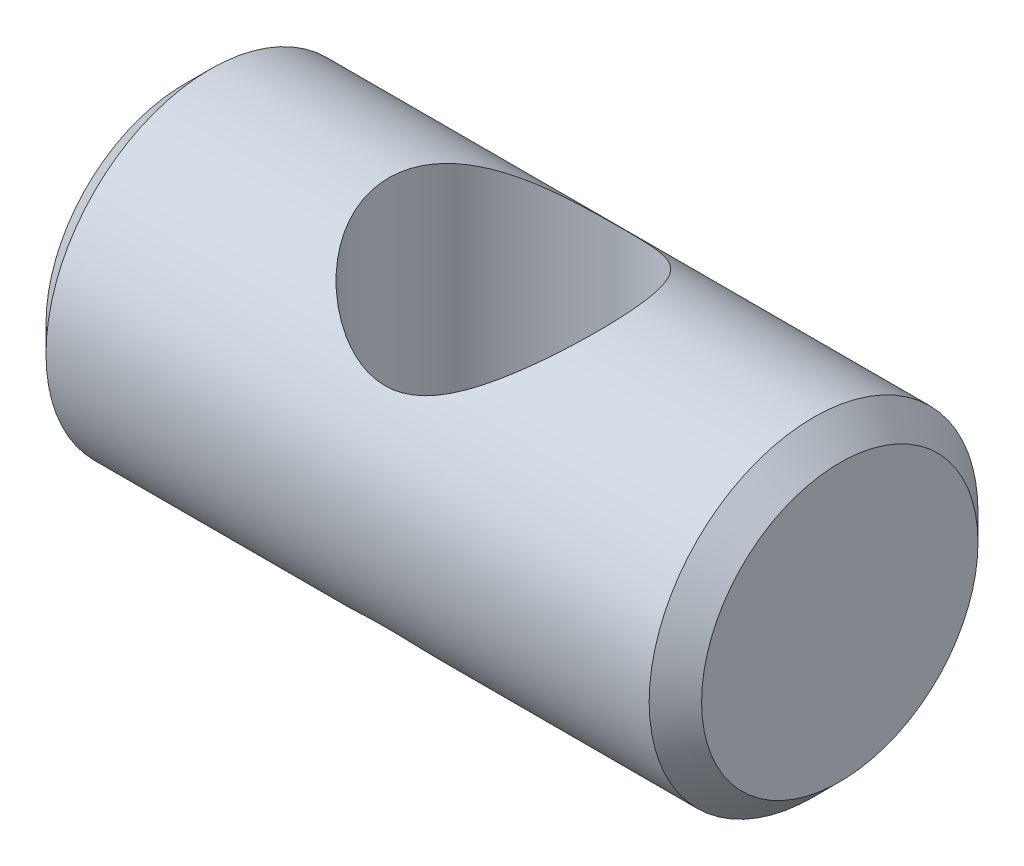
ISO-10303-21;
HEADER;
FILE_DESCRIPTION(('STEP AP214'),'2;1');
FILE_NAME('part.step','',(''),(''),'','','');
FILE_SCHEMA(('AUTOMOTIVE_DESIGN { 1 0 10303 214 1 1 1 1 }'));
ENDSEC;
DATA;
#1=APPLICATION_CONTEXT('core data for automotive mechanical design processes');
#2=APPLICATION_PROTOCOL_DEFINITION('international standard','automotive_design',2000,#1);
#3=PRODUCT_CONTEXT('',#1,'mechanical');
#4=PRODUCT('Part','Part','',(#3));
#5=PRODUCT_RELATED_PRODUCT_CATEGORY('part','',(#4));
#6=PRODUCT_DEFINITION_FORMATION('','',#4);
#7=PRODUCT_DEFINITION_CONTEXT('part definition',#1,'design');
#8=PRODUCT_DEFINITION('design','',#6,#7);
#9=PRODUCT_DEFINITION_SHAPE('','',#8);
#10=(LENGTH_UNIT() NAMED_UNIT(*) SI_UNIT(.MILLI.,.METRE.));
#11=(NAMED_UNIT(*) PLANE_ANGLE_UNIT() SI_UNIT($,.RADIAN.));
#12=(NAMED_UNIT(*) SI_UNIT($,.STERADIAN.) SOLID_ANGLE_UNIT());
#13=UNCERTAINTY_MEASURE_WITH_UNIT(LENGTH_MEASURE(1.E-05),#10,'distance_accuracy_value','');
#14=(GEOMETRIC_REPRESENTATION_CONTEXT(3) GLOBAL_UNCERTAINTY_ASSIGNED_CONTEXT((#13)) GLOBAL_UNIT_ASSIGNED_CONTEXT((#10,
#11,#12)) REPRESENTATION_CONTEXT('',''));
#15=CARTESIAN_POINT('',(0.,0.,0.));
#16=DIRECTION('',(0.,0.,1.));
#17=DIRECTION('',(1.,0.,0.));
#18=AXIS2_PLACEMENT_3D('',#15,#16,#17);
#19=CARTESIAN_POINT('',(9.5,0.,0.));
#20=DIRECTION('',(-1.,0.,0.));
#21=DIRECTION('',(0.,0.,1.));
#22=AXIS2_PLACEMENT_3D('',#19,#20,#21);
#23=CYLINDRICAL_SURFACE('',#22,4.765);
#24=CARTESIAN_POINT('',(-3.42087708051605,-4.765,0.));
#25=CARTESIAN_POINT('',(-3.42696899134864,-4.7649997101109,0.0833627581168181));
#26=CARTESIAN_POINT('',(-3.43001003086423,-4.76280757869707,0.166953392424251));
#27=CARTESIAN_POINT('',(-3.4299899120654,-4.75402028790231,0.333933182408652));
#28=CARTESIAN_POINT('',(-3.42692615604904,-4.74742325494959,0.41732223719261));
#29=CARTESIAN_POINT('',(-3.41478160746824,-4.72989865727235,0.583312250165056));
#30=CARTESIAN_POINT('',(-3.40569315136156,-4.71896558414041,0.665912068503747));
#31=CARTESIAN_POINT('',(-3.38168739143667,-4.69295834085159,0.829610597514771));
#32=CARTESIAN_POINT('',(-3.36676760565251,-4.67788240819801,0.91070865358331));
#33=CARTESIAN_POINT('',(-3.31382161536753,-4.62699847385246,1.15000632689336));
#34=CARTESIAN_POINT('',(-3.26752778272676,-4.58542013528299,1.30524951697123));
#35=CARTESIAN_POINT('',(-3.15544383432779,-4.48962808746058,1.60411463212557));
#36=CARTESIAN_POINT('',(-3.08965416222603,-4.43541466574349,1.74773682156028));
#37=CARTESIAN_POINT('',(-2.93522566350036,-4.31273538578719,2.03259497643689));
#38=CARTESIAN_POINT('',(-2.84518090003159,-4.24347672491827,2.17272279857911));
#39=CARTESIAN_POINT('',(-2.64803347355049,-4.09784606286129,2.43631552731587));
#40=CARTESIAN_POINT('',(-2.54091313456509,-4.02146672501527,2.55976291960052));
#41=CARTESIAN_POINT('',(-2.28757037498761,-3.84950291536883,2.81327393100644));
#42=CARTESIAN_POINT('',(-2.13784494064544,-3.75321839663728,2.93940806717613));
#43=CARTESIAN_POINT('',(-1.89774924473951,-3.61188607024724,3.10885207016274));
#44=CARTESIAN_POINT('',(-1.81509327318893,-3.56527135977744,3.16205944901992));
#45=CARTESIAN_POINT('',(-1.64456461914389,-3.47438917550769,3.26165283895997));
#46=CARTESIAN_POINT('',(-1.55669391813204,-3.43012082209569,3.30804141803447));
#47=CARTESIAN_POINT('',(-1.33801732923479,-3.32784018306176,3.41144333221737));
#48=CARTESIAN_POINT('',(-1.20454764001565,-3.27176419567389,3.46485738281701));
#49=CARTESIAN_POINT('',(-0.92756721927326,-3.17315327144381,3.55539465585279));
#50=CARTESIAN_POINT('',(-0.784080947165173,-3.13058666617785,3.59255605597934));
#51=CARTESIAN_POINT('',(-0.514646140223209,-3.07113542283653,3.64343651296181));
#52=CARTESIAN_POINT('',(-0.389980532152303,-3.05107413064414,3.66010628533956));
#53=CARTESIAN_POINT('',(-0.13805144197163,-3.02761567970702,3.67954153570878));
#54=CARTESIAN_POINT('',(-0.010790737951865,-3.02420155283186,3.68232117171679));
#55=CARTESIAN_POINT('',(0.242449329866106,-3.03458366659267,3.67376621747767));
#56=CARTESIAN_POINT('',(0.368429244158409,-3.04837216824954,3.66243797397314));
#57=CARTESIAN_POINT('',(0.615927376424317,-3.09094772918142,3.62657095184853));
#58=CARTESIAN_POINT('',(0.737438661719832,-3.11975712134959,3.60201250089043));
#59=CARTESIAN_POINT('',(1.02486117239319,-3.20358122773375,3.52797021750044));
#60=CARTESIAN_POINT('',(1.18741075414518,-3.26453704351351,3.47231020523667));
#61=CARTESIAN_POINT('',(1.498121783823,-3.39961296516166,3.34017866781708));
#62=CARTESIAN_POINT('',(1.64623815847782,-3.47377238661047,3.2636446149314));
#63=CARTESIAN_POINT('',(1.87825971607124,-3.60054284241464,3.12200897105521));
#64=CARTESIAN_POINT('',(1.9664324955114,-3.65156363596669,3.06234750531042));
#65=CARTESIAN_POINT('',(2.13658829521524,-3.75440484501345,2.93536296354977));
#66=CARTESIAN_POINT('',(2.21856944344932,-3.80622549668558,2.86803758566651));
#67=CARTESIAN_POINT('',(2.4548169203279,-3.96070606463684,2.65493557738645));
#68=CARTESIAN_POINT('',(2.59972905493882,-4.06258137631192,2.4978237985218));
#69=CARTESIAN_POINT('',(2.83706621766583,-4.23718725327564,2.18575837138568));
#70=CARTESIAN_POINT('',(2.93424360521689,-4.31186637762032,2.03548298499758));
#71=CARTESIAN_POINT('',(3.10568912436017,-4.44824656330391,1.71702572980925));
#72=CARTESIAN_POINT('',(3.17999040299218,-4.50996636079323,1.54887024912961));
#73=CARTESIAN_POINT('',(3.29263516387729,-4.60778480850806,1.22389848309853));
#74=CARTESIAN_POINT('',(3.33468022800881,-4.64632732736096,1.06910753325383));
#75=CARTESIAN_POINT('',(3.39687013419293,-4.70801774696666,0.752190984217971));
#76=CARTESIAN_POINT('',(3.4170259792185,-4.73117337991453,0.590069112764687));
#77=CARTESIAN_POINT('',(3.43390286080123,-4.7606051003247,0.262598143568303));
#78=CARTESIAN_POINT('',(3.43055828056669,-4.76683385814853,0.0972412962651638));
#79=CARTESIAN_POINT('',(3.40010195996678,-4.76222706928004,-0.231024129353293));
#80=CARTESIAN_POINT('',(3.37298745129903,-4.75138953488968,-0.393932420256085));
#81=CARTESIAN_POINT('',(3.29795083571309,-4.71498049061455,-0.705514268669748));
#82=CARTESIAN_POINT('',(3.25098003249397,-4.69006694126301,-0.854498752183594));
#83=CARTESIAN_POINT('',(3.13840780618742,-4.6283363468626,-1.14256413370517));
#84=CARTESIAN_POINT('',(3.07280276883643,-4.59151699239254,-1.28164310390504));
#85=CARTESIAN_POINT('',(2.91796402171938,-4.50478911028579,-1.5605913242394));
#86=CARTESIAN_POINT('',(2.82706121692328,-4.45396042558585,-1.6992420339739));
#87=CARTESIAN_POINT('',(2.62789389216064,-4.34533105232053,-1.96045324775842));
#88=CARTESIAN_POINT('',(2.51961335554432,-4.28752394420402,-2.08299871660834));
#89=CARTESIAN_POINT('',(2.26753986981794,-4.15886196775128,-2.33061071233595));
#90=CARTESIAN_POINT('',(2.12084350362776,-4.08747815085455,-2.45245602746959));
#91=CARTESIAN_POINT('',(1.80818256348861,-3.94818744226299,-2.67091966387116));
#92=CARTESIAN_POINT('',(1.64221717999394,-3.88028069682256,-2.76753692468301));
#93=CARTESIAN_POINT('',(1.32363316444147,-3.76775877390234,-2.91829752704228));
#94=CARTESIAN_POINT('',(1.17388770573105,-3.72114907301219,-2.97693831230802));
#95=CARTESIAN_POINT('',(0.941826581338291,-3.66180847873486,-3.04915600293589));
#96=CARTESIAN_POINT('',(0.863255129060433,-3.64379412637323,-3.07060089781089));
#97=CARTESIAN_POINT('',(0.703992654043787,-3.61197174564401,-3.10797188341903));
#98=CARTESIAN_POINT('',(0.62330269473567,-3.59816164910818,-3.12390068817333));
#99=CARTESIAN_POINT('',(0.459495462666015,-3.57524455910332,-3.15010468685879));
#100=CARTESIAN_POINT('',(0.376361962516613,-3.5661861203942,-3.16032158062367));
#101=CARTESIAN_POINT('',(0.209195138832909,-3.55344451616001,-3.17464168800661));
#102=CARTESIAN_POINT('',(0.125162274904953,-3.54975872585817,-3.17874788699032));
#103=CARTESIAN_POINT('',(-0.0430393452037686,-3.54795587812489,-3.18076053743013));
#104=CARTESIAN_POINT('',(-0.127208095972437,-3.54983860412504,-3.17866722999483));
#105=CARTESIAN_POINT('',(-0.294840628996079,-3.55905933774995,-3.16833758034575));
#106=CARTESIAN_POINT('',(-0.378304441298767,-3.56639711165655,-3.16010150131517));
#107=CARTESIAN_POINT('',(-0.604314657609785,-3.59341005189328,-3.129430196119));
#108=CARTESIAN_POINT('',(-0.745494317394035,-3.61818171011667,-3.10101793603989));
#109=CARTESIAN_POINT('',(-1.0206998312674,-3.67972750014127,-3.02771937958645));
#110=CARTESIAN_POINT('',(-1.1547183301723,-3.71651370639189,-2.98281650470617));
#111=CARTESIAN_POINT('',(-1.46853642894096,-3.8153502491925,-2.8560768918245));
#112=CARTESIAN_POINT('',(-1.64398166227299,-3.88152734494911,-2.76664814536404));
#113=CARTESIAN_POINT('',(-1.97551522842484,-4.02033820070584,-2.56077346334119));
#114=CARTESIAN_POINT('',(-2.13156938380249,-4.09298298410994,-2.44428083509273));
#115=CARTESIAN_POINT('',(-2.42421216807333,-4.2373970566927,-2.18450650401399));
#116=CARTESIAN_POINT('',(-2.56052605726515,-4.30914323590253,-2.04090097393914));
#117=CARTESIAN_POINT('',(-2.80802181758103,-4.44318432752427,-1.72973058522059));
#118=CARTESIAN_POINT('',(-2.91923707314103,-4.50549175797245,-1.56219804304703));
#119=CARTESIAN_POINT('',(-3.09396462152009,-4.60338031575656,-1.23969583506405));
#120=CARTESIAN_POINT('',(-3.16252149709776,-4.64178783933997,-1.08834922542924));
#121=CARTESIAN_POINT('',(-3.24875451241662,-4.68864069192958,-0.853387810710917));
#122=CARTESIAN_POINT('',(-3.27471971164357,-4.70245945854321,-0.773800863355166));
#123=CARTESIAN_POINT('',(-3.32087000112459,-4.72618391319332,-0.612411306870994));
#124=CARTESIAN_POINT('',(-3.34105760799584,-4.73609130567107,-0.530609679466054));
#125=CARTESIAN_POINT('',(-3.37353939001354,-4.75084997254152,-0.374335243630174));
#126=CARTESIAN_POINT('',(-3.38645258471521,-4.75613339853629,-0.300030947704156));
#127=CARTESIAN_POINT('',(-3.40736829831093,-4.76320900575073,-0.150546671086999));
#128=CARTESIAN_POINT('',(-3.41536951590209,-4.76500026208246,-0.0753664637160967));
#129=CARTESIAN_POINT('',(-3.42087708051605,-4.765,0.));
#130=B_SPLINE_CURVE_WITH_KNOTS('',3,(#24,#25,#26,#27,#28,#29,#30,#31,#32,#33,#34,#35,#36,#37,
#38,#39,#40,#41,#42,#43,#44,#45,#46,#47,#48,#49,#50,#51,#52,#53,#54,#55,#56,#57,#58,#59,#60,#61,
#62,#63,#64,#65,#66,#67,#68,#69,#70,#71,#72,#73,#74,#75,#76,#77,#78,#79,#80,#81,#82,#83,#84,#85,
#86,#87,#88,#89,#90,#91,#92,#93,#94,#95,#96,#97,#98,#99,#100,#101,#102,#103,#104,#105,#106,#107,
#108,#109,#110,#111,#112,#113,#114,#115,#116,#117,#118,#119,#120,#121,#122,#123,#124,#125,#126,
#127,#128,#129),.UNSPECIFIED.,.T.,.F.,(4,2,2,2,2,2,2,2,2,2,2,2,2,2,2,2,2,2,2,2,2,2,2,2,2,2,2,2,
2,2,2,2,2,2,2,2,2,2,2,2,2,2,2,2,2,2,2,2,2,2,2,2,4),(0.,0.250678148817341,0.501462988541287,
0.752567445437252,1.00377889552888,1.50309474088369,2.00239922444642,2.54160992918404,
3.08138247258981,3.73300244855075,4.05909733145616,4.38506908912952,4.84654436743379,
5.30692973453839,5.68734604359481,6.06737452056514,6.44723209503533,6.82765605484285,
7.37157480546313,7.91714109472133,8.27090631470675,8.62477807035776,9.33119791439566,
9.91077027397039,10.4894988486046,10.9822712500665,11.4747958366297,11.9686961727678,
12.4626540373564,12.9352342359093,13.4079061579591,13.9261848288361,14.4449439577641,
15.0533142145202,15.6617100398795,16.1619385675779,16.4119146790501,16.6617676221917,
16.9141262556176,17.1663615593023,17.4185870532858,17.6708017414467,18.1072101440206,
18.5440584873629,19.1640002904501,19.7850197135797,20.4139885307568,21.0421157411608,
21.5513660687497,21.8056438515067,22.059810706191,22.2863833912941,22.5130160751694),.UNSPECIFIED.);
#131=CARTESIAN_POINT('',(-3.42087708051605,-4.765,0.));
#132=VERTEX_POINT('',#131);
#133=EDGE_CURVE('E10',#132,#132,#130,.T.);
#134=ORIENTED_EDGE('',*,*,#133,.T.);
#135=EDGE_LOOP('',(#134));
#136=FACE_BOUND('',#135,.T.);
#137=CARTESIAN_POINT('',(0.,3.0270158572429,3.68));
#138=CARTESIAN_POINT('',(-0.0785672773316466,3.02701614791727,3.67999984364138));
#139=CARTESIAN_POINT('',(-0.157136135576355,3.03031605642996,3.67729277636747));
#140=CARTESIAN_POINT('',(-0.313369541449519,3.04330147157753,3.66655295600809));
#141=CARTESIAN_POINT('',(-0.391034010912772,3.05298752605126,3.65851974601636));
#142=CARTESIAN_POINT('',(-0.544942339151606,3.07820352988238,3.63732812874269));
#143=CARTESIAN_POINT('',(-0.621180877977561,3.09375201630091,3.62415345944192));
#144=CARTESIAN_POINT('',(-0.771468880528866,3.12988210454059,3.59299821855179));
#145=CARTESIAN_POINT('',(-0.845516665983406,3.15046745848851,3.57501406328682));
#146=CARTESIAN_POINT('',(-1.09433047382612,3.22791462831318,3.50587087765695));
#147=CARTESIAN_POINT('',(-1.26309282362243,3.2948386580286,3.44382003292069));
#148=CARTESIAN_POINT('',(-1.50370711041474,3.40467601246938,3.33408533723919));
#149=CARTESIAN_POINT('',(-1.58189244838754,3.44290479326835,3.29468500807198));
#150=CARTESIAN_POINT('',(-1.73423285237257,3.52148653298938,3.21055545325705));
#151=CARTESIAN_POINT('',(-1.80838881793449,3.56183901380659,3.16582742418489));
#152=CARTESIAN_POINT('',(-2.02850482582812,3.68672600847628,3.02153691887044));
#153=CARTESIAN_POINT('',(-2.16807869449587,3.77315168849593,2.9137218740972));
#154=CARTESIAN_POINT('',(-2.42959010373283,3.94426933228633,2.67754924945123));
#155=CARTESIAN_POINT('',(-2.55153658554773,4.0289621561759,2.54920215427041));
#156=CARTESIAN_POINT('',(-2.77693730786715,4.1919505214112,2.27132648174838));
#157=CARTESIAN_POINT('',(-2.88023478105728,4.27018907543985,2.12163570850646));
#158=CARTESIAN_POINT('',(-3.06369900830999,4.41409842691616,1.80316374111448));
#159=CARTESIAN_POINT('',(-3.14388622560065,4.47978032533083,1.63439962117957));
#160=CARTESIAN_POINT('',(-3.26635689009236,4.58439476517905,1.30881127520956));
#161=CARTESIAN_POINT('',(-3.3126324755552,4.62591646772974,1.15433056577145));
#162=CARTESIAN_POINT('',(-3.38325654959983,4.69367027218436,0.837202280830255));
#163=CARTESIAN_POINT('',(-3.40762001451853,4.7199128126465,0.674560363681943));
#164=CARTESIAN_POINT('',(-3.43267527752513,4.75538994748078,0.345016918949487));
#165=CARTESIAN_POINT('',(-3.43328564995364,4.76456593536209,0.178102701594287));
#166=CARTESIAN_POINT('',(-3.41018166140549,4.76540378920208,-0.154080808504465));
#167=CARTESIAN_POINT('',(-3.38646547727926,4.75706434242047,-0.319349977022771));
#168=CARTESIAN_POINT('',(-3.31775156953333,4.72510260499364,-0.634317782486344));
#169=CARTESIAN_POINT('',(-3.27397352746067,4.70233080305011,-0.784375176401476));
#170=CARTESIAN_POINT('',(-3.16750864597913,4.64450941494238,-1.07505429218324));
#171=CARTESIAN_POINT('',(-3.10481828431148,4.60945754152293,-1.21567425043883));
#172=CARTESIAN_POINT('',(-2.95652856255593,4.52638674091888,-1.49677788855974));
#173=CARTESIAN_POINT('',(-2.86942133720828,4.47751111873768,-1.63620711351601));
#174=CARTESIAN_POINT('',(-2.67788120319372,4.37232420780869,-1.89951272145431));
#175=CARTESIAN_POINT('',(-2.57343424063936,4.31600689517522,-2.02337634423388));
#176=CARTESIAN_POINT('',(-2.32992989714121,4.18996971318213,-2.27426780979749));
#177=CARTESIAN_POINT('',(-2.18800876851398,4.11960732735629,-2.39819784816122));
#178=CARTESIAN_POINT('',(-1.88505782163776,3.98107848473248,-2.62174133186739));
#179=CARTESIAN_POINT('',(-1.72402241690679,3.91291267736107,-2.72134764203992));
#180=CARTESIAN_POINT('',(-1.40961518716303,3.79636450990898,-2.881168849186));
#181=CARTESIAN_POINT('',(-1.25863725138286,3.74654731116981,-2.94503209171546));
#182=CARTESIAN_POINT('',(-0.945527440392479,3.66060402226399,-3.05121747931762));
#183=CARTESIAN_POINT('',(-0.783414037013456,3.62445587601066,-3.09357436476774));
#184=CARTESIAN_POINT('',(-0.533813056438615,3.58476149841442,-3.13928376884266));
#185=CARTESIAN_POINT('',(-0.449028547115526,3.57393161480045,-3.15156761613341));
#186=CARTESIAN_POINT('',(-0.278275024285713,3.55780077117141,-3.16976872881678));
#187=CARTESIAN_POINT('',(-0.192306660171836,3.5524968934398,-3.17568935402606));
#188=CARTESIAN_POINT('',(-0.0200327709043165,3.54772147962291,-3.18102355866001));
#189=CARTESIAN_POINT('',(0.0662726316081429,3.54824798964232,-3.18043931801256));
#190=CARTESIAN_POINT('',(0.238338872801624,3.55508375410915,-3.17279435887041));
#191=CARTESIAN_POINT('',(0.324099748085622,3.56139261563451,-3.16573408043508));
#192=CARTESIAN_POINT('',(0.553401842306172,3.58576306843395,-3.13816835119393));
#193=CARTESIAN_POINT('',(0.695739197403439,3.60894237647337,-3.11173256017326));
#194=CARTESIAN_POINT('',(0.973480788870407,3.6678298405413,-3.04208625520151));
#195=CARTESIAN_POINT('',(1.10887734054378,3.70355155394913,-2.99885758403296));
#196=CARTESIAN_POINT('',(1.42379146726814,3.7997001514418,-2.87675019956371));
#197=CARTESIAN_POINT('',(1.59919673865542,3.86428769996493,-2.79052654374781));
#198=CARTESIAN_POINT('',(1.93113815119942,4.00059813210694,-2.59133845951309));
#199=CARTESIAN_POINT('',(2.08764088718698,4.07233325050109,-2.47832770642991));
#200=CARTESIAN_POINT('',(2.38199709911893,4.21579037939226,-2.22570370446708));
#201=CARTESIAN_POINT('',(2.51955338419097,4.28749766673045,-2.08573466326166));
#202=CARTESIAN_POINT('',(2.77028243502778,4.42234806198233,-1.78201502187867));
#203=CARTESIAN_POINT('',(2.88349257282064,4.48550424008068,-1.61830152645774));
#204=CARTESIAN_POINT('',(3.06402610957439,4.58658548395503,-1.30045140866569));
#205=CARTESIAN_POINT('',(3.13591982023922,4.62699541781642,-1.14970877890861));
#206=CARTESIAN_POINT('',(3.25766051296821,4.69370617156705,-0.836599849304391));
#207=CARTESIAN_POINT('',(3.30752205037566,4.7200163088041,-0.674241306034808));
#208=CARTESIAN_POINT('',(3.3829870904449,4.75572615385405,-0.341241432427484));
#209=CARTESIAN_POINT('',(3.40846923089666,4.7650414665297,-0.170563063438746));
#210=CARTESIAN_POINT('',(3.4334390909829,4.76495829995348,0.172677006169807));
#211=CARTESIAN_POINT('',(3.43293306367628,4.7555643228997,0.345238243758834));
#212=CARTESIAN_POINT('',(3.40754400048731,4.71998636563285,0.672126495727839));
#213=CARTESIAN_POINT('',(3.38468468821344,4.69525837988108,0.82677947345949));
#214=CARTESIAN_POINT('',(3.31910619707247,4.63193340521078,1.12882616508402));
#215=CARTESIAN_POINT('',(3.27638180384756,4.59333277548538,1.27621796175837));
#216=CARTESIAN_POINT('',(3.17042951924722,4.50215126554465,1.5686260572414));
#217=CARTESIAN_POINT('',(3.10621371599284,4.44892473542071,1.71307815224114));
#218=CARTESIAN_POINT('',(2.96073945861412,4.33272638873523,1.98874620073681));
#219=CARTESIAN_POINT('',(2.87947919610232,4.26975353829207,2.11996074756245));
#220=CARTESIAN_POINT('',(2.68651050838254,4.12556821291774,2.39003735747662));
#221=CARTESIAN_POINT('',(2.57196063848181,4.04309554925752,2.52618739114482));
#222=CARTESIAN_POINT('',(2.32447412944917,3.87408431941462,2.77844859407009));
#223=CARTESIAN_POINT('',(2.19149095139184,3.78753584009049,2.89450731580785));
#224=CARTESIAN_POINT('',(1.96595276183287,3.65130486353125,3.06263487303052));
#225=CARTESIAN_POINT('',(1.87886470860019,3.60090149373494,3.12157066922301));
#226=CARTESIAN_POINT('',(1.69862262017005,3.50236607543005,3.23173475735497));
#227=CARTESIAN_POINT('',(1.60546616441238,3.45423494663789,3.28295994638551));
#228=CARTESIAN_POINT('',(1.41335402823623,3.36225362869259,3.37709887635029));
#229=CARTESIAN_POINT('',(1.31441341048654,3.31839304937429,3.4200330530899));
#230=CARTESIAN_POINT('',(1.11061583662532,3.23713845030014,3.49704051581634));
#231=CARTESIAN_POINT('',(1.00576424358737,3.19973868995705,3.53112168161428));
#232=CARTESIAN_POINT('',(0.826860618617419,3.1451674862639,3.57966454279998));
#233=CARTESIAN_POINT('',(0.754330914941613,3.12542579098052,3.59686794878708));
#234=CARTESIAN_POINT('',(0.607204587985835,3.09080711138969,3.62665947956898));
#235=CARTESIAN_POINT('',(0.532609008476298,3.07592771737776,3.63924989089071));
#236=CARTESIAN_POINT('',(0.382096659839413,3.05181598122002,3.65949364139542));
#237=CARTESIAN_POINT('',(0.306185151895196,3.04256489437812,3.66716337327478));
#238=CARTESIAN_POINT('',(0.153516252829607,3.03016475948479,3.67741657137031));
#239=CARTESIAN_POINT('',(0.0767588809019649,3.02701557325904,3.68000015275969));
#240=CARTESIAN_POINT('',(0.,3.0270158572429,3.68));
#241=B_SPLINE_CURVE_WITH_KNOTS('',3,(#137,#138,#139,#140,#141,#142,#143,#144,#145,#146,#147,
#148,#149,#150,#151,#152,#153,#154,#155,#156,#157,#158,#159,#160,#161,#162,#163,#164,#165,#166,
#167,#168,#169,#170,#171,#172,#173,#174,#175,#176,#177,#178,#179,#180,#181,#182,#183,#184,#185,
#186,#187,#188,#189,#190,#191,#192,#193,#194,#195,#196,#197,#198,#199,#200,#201,#202,#203,#204,
#205,#206,#207,#208,#209,#210,#211,#212,#213,#214,#215,#216,#217,#218,#219,#220,#221,#222,#223,
#224,#225,#226,#227,#228,#229,#230,#231,#232,#233,#234,#235,#236,#237,#238,#239,#240),
.UNSPECIFIED.,.T.,.F.,(4,2,2,2,2,2,2,2,2,2,2,2,2,2,2,2,2,2,2,2,2,2,2,2,2,2,2,2,2,2,2,2,2,2,2,2,
2,2,2,2,2,2,2,2,2,2,2,2,2,2,2,4),(0.,0.235591708988226,0.471203630963838,0.707566894291256,
0.944106771258296,1.51591397043087,1.80236618274396,2.08875418016066,2.67592975620556,
3.26280644257577,3.85440755326201,4.44548320346413,4.94292664174491,5.44002983205938,
5.93883694376225,6.43768144120931,6.9095606777859,7.38152785217115,7.89413675044232,
8.40716316586385,9.00813916387887,9.60929124216605,10.1214610992978,10.6328009675269,
10.8914987801306,11.1500599316432,11.4085344360666,11.6669913779457,12.1048085655684,
12.5431004643861,13.1573710774192,13.7727118402267,14.3968121302921,15.0199474601663,
15.5333029695888,16.0463188267164,16.5618754223646,17.077307969612,17.550023970907,
18.0228641248864,18.5213957266873,19.0199802486027,19.6062313855034,20.1939905554461,
20.5434646283834,20.8930789631276,21.2418202453876,21.5902500511245,21.8213124314337,
22.0522601254179,22.2824343920731,22.5126034464923),.UNSPECIFIED.);
#242=CARTESIAN_POINT('',(0.,3.0270158572429,3.68));
#243=VERTEX_POINT('',#242);
#244=EDGE_CURVE('E42',#243,#243,#241,.T.);
#245=ORIENTED_EDGE('',*,*,#244,.T.);
#246=EDGE_LOOP('',(#245));
#247=FACE_BOUND('',#246,.T.);
#248=CARTESIAN_POINT('',(-8.74,0.,0.));
#249=DIRECTION('',(1.,0.,0.));
#250=DIRECTION('',(0.,0.,-1.));
#251=AXIS2_PLACEMENT_3D('',#248,#249,#250);
#252=CIRCLE('',#251,4.765);
#253=CARTESIAN_POINT('',(-8.74,0.,-4.765));
#254=VERTEX_POINT('',#253);
#255=EDGE_CURVE('E83',#254,#254,#252,.T.);
#256=ORIENTED_EDGE('',*,*,#255,.T.);
#257=EDGE_LOOP('',(#256));
#258=FACE_BOUND('',#257,.T.);
#259=CARTESIAN_POINT('',(8.73999999999999,0.,0.));
#260=DIRECTION('',(1.,0.,0.));
#261=DIRECTION('',(0.,0.,-1.));
#262=AXIS2_PLACEMENT_3D('',#259,#260,#261);
#263=CIRCLE('',#262,4.765);
#264=CARTESIAN_POINT('',(8.73999999999999,0.,-4.765));
#265=VERTEX_POINT('',#264);
#266=EDGE_CURVE('E86',#265,#265,#263,.F.);
#267=ORIENTED_EDGE('',*,*,#266,.T.);
#268=EDGE_LOOP('',(#267));
#269=FACE_BOUND('',#268,.T.);
#270=ADVANCED_FACE('F30',(#136,#247,#258,#269),#23,.T.);
#271=CARTESIAN_POINT('',(9.5,0.,0.));
#272=DIRECTION('',(1.,0.,0.));
#273=DIRECTION('',(0.,0.,-1.));
#274=AXIS2_PLACEMENT_3D('',#271,#272,#273);
#275=PLANE('',#274);
#276=CARTESIAN_POINT('',(9.5,0.,0.));
#277=DIRECTION('',(1.,0.,0.));
#278=DIRECTION('',(0.,0.,-1.));
#279=AXIS2_PLACEMENT_3D('',#276,#277,#278);
#280=CIRCLE('',#279,4.00499999999999);
#281=CARTESIAN_POINT('',(9.5,0.,-4.00499999999999));
#282=VERTEX_POINT('',#281);
#283=EDGE_CURVE('E46',#282,#282,#280,.T.);
#284=ORIENTED_EDGE('',*,*,#283,.T.);
#285=EDGE_LOOP('',(#284));
#286=FACE_BOUND('',#285,.T.);
#287=ADVANCED_FACE('F63',(#286),#275,.T.);
#288=CARTESIAN_POINT('',(-9.5,0.,0.));
#289=DIRECTION('',(1.,0.,0.));
#290=DIRECTION('',(0.,0.,-1.));
#291=AXIS2_PLACEMENT_3D('',#288,#289,#290);
#292=PLANE('',#291);
#293=CARTESIAN_POINT('',(-9.5,0.,0.));
#294=DIRECTION('',(1.,0.,0.));
#295=DIRECTION('',(0.,0.,-1.));
#296=AXIS2_PLACEMENT_3D('',#293,#294,#295);
#297=CIRCLE('',#296,4.00499999999999);
#298=CARTESIAN_POINT('',(-9.5,0.,-4.00499999999999));
#299=VERTEX_POINT('',#298);
#300=EDGE_CURVE('E50',#299,#299,#297,.F.);
#301=ORIENTED_EDGE('',*,*,#300,.T.);
#302=EDGE_LOOP('',(#301));
#303=FACE_BOUND('',#302,.T.);
#304=ADVANCED_FACE('F66',(#303),#292,.F.);
#305=CARTESIAN_POINT('',(-8.74,0.,0.));
#306=DIRECTION('',(1.,0.,0.));
#307=DIRECTION('',(0.,0.,-1.));
#308=AXIS2_PLACEMENT_3D('',#305,#306,#307);
#309=CONICAL_SURFACE('',#308,4.765,0.785398163397451);
#310=ORIENTED_EDGE('',*,*,#300,.F.);
#311=EDGE_LOOP('',(#310));
#312=FACE_BOUND('',#311,.T.);
#313=ORIENTED_EDGE('',*,*,#255,.F.);
#314=EDGE_LOOP('',(#313));
#315=FACE_BOUND('',#314,.T.);
#316=ADVANCED_FACE('F69',(#312,#315),#309,.T.);
#317=CARTESIAN_POINT('',(9.5,0.,0.));
#318=DIRECTION('',(-1.,0.,0.));
#319=DIRECTION('',(0.,0.,1.));
#320=AXIS2_PLACEMENT_3D('',#317,#318,#319);
#321=CONICAL_SURFACE('',#320,4.00499999999999,0.785398163397447);
#322=ORIENTED_EDGE('',*,*,#266,.F.);
#323=EDGE_LOOP('',(#322));
#324=FACE_BOUND('',#323,.T.);
#325=ORIENTED_EDGE('',*,*,#283,.F.);
#326=EDGE_LOOP('',(#325));
#327=FACE_BOUND('',#326,.T.);
#328=ADVANCED_FACE('F32',(#324,#327),#321,.T.);
#329=CARTESIAN_POINT('',(0.,-4.765,0.25));
#330=DIRECTION('',(0.,1.,0.));
#331=DIRECTION('',(0.,0.,1.));
#332=AXIS2_PLACEMENT_3D('',#329,#330,#331);
#333=CYLINDRICAL_SURFACE('',#332,3.43);
#334=ORIENTED_EDGE('',*,*,#244,.F.);
#335=EDGE_LOOP('',(#334));
#336=FACE_BOUND('',#335,.T.);
#337=ORIENTED_EDGE('',*,*,#133,.F.);
#338=EDGE_LOOP('',(#337));
#339=FACE_BOUND('',#338,.T.);
#340=ADVANCED_FACE('F58',(#336,#339),#333,.F.);
#341=CLOSED_SHELL('',(#270,#287,#304,#316,#328,#340));
#342=MANIFOLD_SOLID_BREP('B2',#341);
#343=ADVANCED_BREP_SHAPE_REPRESENTATION('',(#18,#342),#14);
#344=SHAPE_DEFINITION_REPRESENTATION(#9,#343);
ENDSEC;
END-ISO-10303-21;
